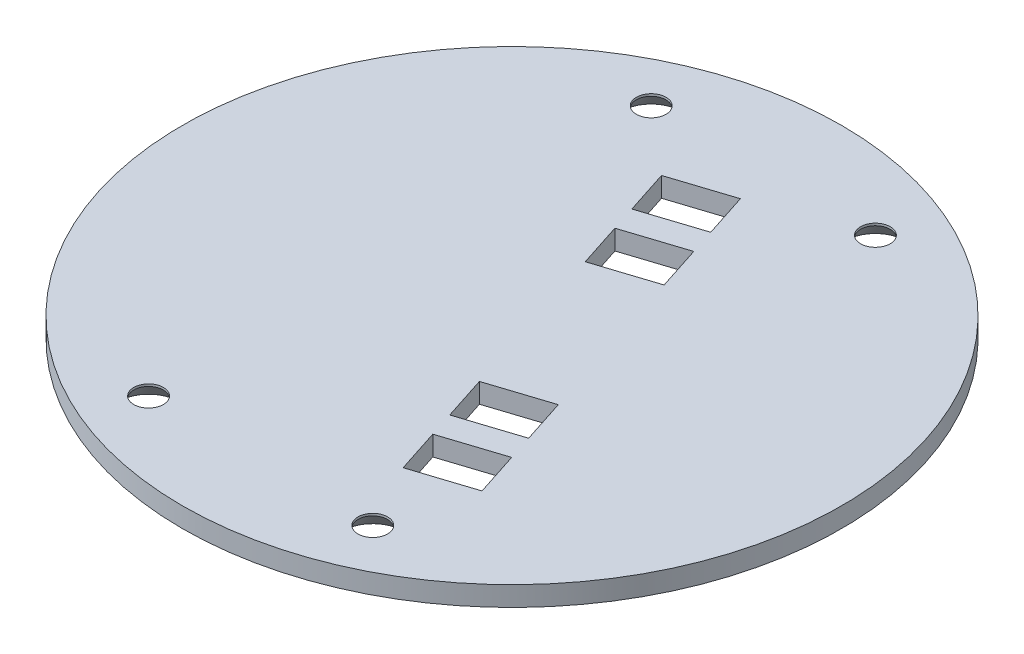
ISO-10303-21;
HEADER;
FILE_DESCRIPTION(('STEP AP214'),'2;1');
FILE_NAME('part.step','',(''),(''),'','','');
FILE_SCHEMA(('AUTOMOTIVE_DESIGN { 1 0 10303 214 1 1 1 1 }'));
ENDSEC;
DATA;
#1=APPLICATION_CONTEXT('core data for automotive mechanical design processes');
#2=APPLICATION_PROTOCOL_DEFINITION('international standard','automotive_design',2000,#1);
#3=PRODUCT_CONTEXT('',#1,'mechanical');
#4=PRODUCT('Part','Part','',(#3));
#5=PRODUCT_RELATED_PRODUCT_CATEGORY('part','',(#4));
#6=PRODUCT_DEFINITION_FORMATION('','',#4);
#7=PRODUCT_DEFINITION_CONTEXT('part definition',#1,'design');
#8=PRODUCT_DEFINITION('design','',#6,#7);
#9=PRODUCT_DEFINITION_SHAPE('','',#8);
#10=(LENGTH_UNIT() NAMED_UNIT(*) SI_UNIT(.MILLI.,.METRE.));
#11=(NAMED_UNIT(*) PLANE_ANGLE_UNIT() SI_UNIT($,.RADIAN.));
#12=(NAMED_UNIT(*) SI_UNIT($,.STERADIAN.) SOLID_ANGLE_UNIT());
#13=UNCERTAINTY_MEASURE_WITH_UNIT(LENGTH_MEASURE(1.E-05),#10,'distance_accuracy_value','');
#14=(GEOMETRIC_REPRESENTATION_CONTEXT(3) GLOBAL_UNCERTAINTY_ASSIGNED_CONTEXT((#13)) GLOBAL_UNIT_ASSIGNED_CONTEXT((#10,
#11,#12)) REPRESENTATION_CONTEXT('',''));
#15=CARTESIAN_POINT('',(0.,0.,0.));
#16=DIRECTION('',(0.,0.,1.));
#17=DIRECTION('',(1.,0.,0.));
#18=AXIS2_PLACEMENT_3D('',#15,#16,#17);
#19=CARTESIAN_POINT('',(0.,1.5,0.));
#20=DIRECTION('',(0.,1.,0.));
#21=DIRECTION('',(0.,0.,1.));
#22=AXIS2_PLACEMENT_3D('',#19,#20,#21);
#23=PLANE('',#22);
#24=CARTESIAN_POINT('',(17.0092592584861,1.5,38.1280421668568));
#25=DIRECTION('',(0.,-1.,0.));
#26=DIRECTION('',(0.,0.,-1.));
#27=AXIS2_PLACEMENT_3D('',#24,#25,#26);
#28=CIRCLE('',#27,2.2479);
#29=CARTESIAN_POINT('',(17.0092592584861,1.5,35.8801421668568));
#30=VERTEX_POINT('',#29);
#31=EDGE_CURVE('E365',#30,#30,#28,.T.);
#32=ORIENTED_EDGE('',*,*,#31,.T.);
#33=EDGE_LOOP('',(#32));
#34=FACE_BOUND('',#33,.T.);
#35=CARTESIAN_POINT('',(-17.0092592584861,1.5,38.1280421668568));
#36=DIRECTION('',(0.,-1.,0.));
#37=DIRECTION('',(0.,0.,-1.));
#38=AXIS2_PLACEMENT_3D('',#35,#36,#37);
#39=CIRCLE('',#38,2.2479);
#40=CARTESIAN_POINT('',(-17.0092592584861,1.5,35.8801421668568));
#41=VERTEX_POINT('',#40);
#42=EDGE_CURVE('E369',#41,#41,#39,.T.);
#43=ORIENTED_EDGE('',*,*,#42,.T.);
#44=EDGE_LOOP('',(#43));
#45=FACE_BOUND('',#44,.T.);
#46=CARTESIAN_POINT('',(-17.009259258486,1.5,-38.1280421668568));
#47=DIRECTION('',(0.,-1.,0.));
#48=DIRECTION('',(0.,0.,-1.));
#49=AXIS2_PLACEMENT_3D('',#46,#47,#48);
#50=CIRCLE('',#49,2.2479);
#51=CARTESIAN_POINT('',(-17.009259258486,1.5,-40.3759421668567));
#52=VERTEX_POINT('',#51);
#53=EDGE_CURVE('E373',#52,#52,#50,.T.);
#54=ORIENTED_EDGE('',*,*,#53,.T.);
#55=EDGE_LOOP('',(#54));
#56=FACE_BOUND('',#55,.T.);
#57=CARTESIAN_POINT('',(17.009259258486,1.5,-38.1280421668568));
#58=DIRECTION('',(0.,-1.,0.));
#59=DIRECTION('',(0.,0.,-1.));
#60=AXIS2_PLACEMENT_3D('',#57,#58,#59);
#61=CIRCLE('',#60,2.2479);
#62=CARTESIAN_POINT('',(17.009259258486,1.5,-40.3759421668567));
#63=VERTEX_POINT('',#62);
#64=EDGE_CURVE('E377',#63,#63,#61,.T.);
#65=ORIENTED_EDGE('',*,*,#64,.T.);
#66=EDGE_LOOP('',(#65));
#67=FACE_BOUND('',#66,.T.);
#68=DIRECTION('',(0.308303520094528,0.,0.951288042339082));
#69=VECTOR('',#68,1.);
#70=CARTESIAN_POINT('',(-7.06797710635094,1.5,-29.7553595949385));
#71=LINE('',#70,#69);
#72=CARTESIAN_POINT('',(-7.06797710635094,1.5,-29.7553595949385));
#73=VERTEX_POINT('',#72);
#74=CARTESIAN_POINT('',(-4.90985246568924,1.5,-23.0963432985649));
#75=VERTEX_POINT('',#74);
#76=EDGE_CURVE('E54',#73,#75,#71,.T.);
#77=ORIENTED_EDGE('',*,*,#76,.F.);
#78=DIRECTION('',(-0.951288042339082,0.,0.308303520094528));
#79=VECTOR('',#78,1.);
#80=CARTESIAN_POINT('',(1.96925929587035,1.5,-32.6842430358365));
#81=LINE('',#80,#79);
#82=CARTESIAN_POINT('',(1.96925929587035,1.5,-32.6842430358365));
#83=VERTEX_POINT('',#82);
#84=EDGE_CURVE('E171',#83,#73,#81,.T.);
#85=ORIENTED_EDGE('',*,*,#84,.F.);
#86=DIRECTION('',(-0.308303520094528,0.,-0.951288042339082));
#87=VECTOR('',#86,1.);
#88=CARTESIAN_POINT('',(4.12738393653204,1.5,-26.025226739463));
#89=LINE('',#88,#87);
#90=CARTESIAN_POINT('',(4.12738393653204,1.5,-26.025226739463));
#91=VERTEX_POINT('',#90);
#92=EDGE_CURVE('E177',#91,#83,#89,.T.);
#93=ORIENTED_EDGE('',*,*,#92,.F.);
#94=DIRECTION('',(0.951288042339082,0.,-0.308303520094528));
#95=VECTOR('',#94,1.);
#96=CARTESIAN_POINT('',(-4.90985246568924,1.5,-23.0963432985649));
#97=LINE('',#96,#95);
#98=EDGE_CURVE('E189',#75,#91,#97,.T.);
#99=ORIENTED_EDGE('',*,*,#98,.F.);
#100=EDGE_LOOP('',(#77,#85,#93,#99));
#101=FACE_BOUND('',#100,.T.);
#102=DIRECTION('',(-0.308303520094528,0.,-0.951288042339082));
#103=VECTOR('',#102,1.);
#104=CARTESIAN_POINT('',(5.36059801691015,1.5,-22.2200745701066));
#105=LINE('',#104,#103);
#106=CARTESIAN_POINT('',(7.51872265757185,1.5,-15.5610582737331));
#107=VERTEX_POINT('',#106);
#108=CARTESIAN_POINT('',(5.36059801691015,1.5,-22.2200745701066));
#109=VERTEX_POINT('',#108);
#110=EDGE_CURVE('E199',#107,#109,#105,.T.);
#111=ORIENTED_EDGE('',*,*,#110,.F.);
#112=DIRECTION('',(0.951288042339082,0.,-0.308303520094528));
#113=VECTOR('',#112,1.);
#114=CARTESIAN_POINT('',(7.51872265757185,1.5,-15.5610582737331));
#115=LINE('',#114,#113);
#116=CARTESIAN_POINT('',(-1.51851374464943,1.5,-12.632174832835));
#117=VERTEX_POINT('',#116);
#118=EDGE_CURVE('E210',#117,#107,#115,.T.);
#119=ORIENTED_EDGE('',*,*,#118,.F.);
#120=DIRECTION('',(0.308303520094528,0.,0.951288042339082));
#121=VECTOR('',#120,1.);
#122=CARTESIAN_POINT('',(-1.51851374464943,1.5,-12.632174832835));
#123=LINE('',#122,#121);
#124=CARTESIAN_POINT('',(-3.67663838531113,1.5,-19.2911911292086));
#125=VERTEX_POINT('',#124);
#126=EDGE_CURVE('E229',#125,#117,#123,.T.);
#127=ORIENTED_EDGE('',*,*,#126,.F.);
#128=DIRECTION('',(-0.951288042339082,0.,0.308303520094528));
#129=VECTOR('',#128,1.);
#130=CARTESIAN_POINT('',(-3.67663838531113,1.5,-19.2911911292086));
#131=LINE('',#130,#129);
#132=EDGE_CURVE('E225',#109,#125,#131,.T.);
#133=ORIENTED_EDGE('',*,*,#132,.F.);
#134=EDGE_LOOP('',(#111,#119,#127,#133));
#135=FACE_BOUND('',#134,.T.);
#136=DIRECTION('',(0.308303520094527,0.,0.951288042339082));
#137=VECTOR('',#136,1.);
#138=CARTESIAN_POINT('',(11.7292885138124,1.5,28.2446723464753));
#139=LINE('',#138,#137);
#140=CARTESIAN_POINT('',(9.57116387315074,1.5,21.5856560501018));
#141=VERTEX_POINT('',#140);
#142=CARTESIAN_POINT('',(11.7292885138124,1.5,28.2446723464753));
#143=VERTEX_POINT('',#142);
#144=EDGE_CURVE('E239',#141,#143,#139,.T.);
#145=ORIENTED_EDGE('',*,*,#144,.F.);
#146=DIRECTION('',(-0.951288042339082,0.,0.308303520094527));
#147=VECTOR('',#146,1.);
#148=CARTESIAN_POINT('',(9.57116387315074,1.5,21.5856560501018));
#149=LINE('',#148,#147);
#150=CARTESIAN_POINT('',(18.608400275372,1.5,18.6567726092037));
#151=VERTEX_POINT('',#150);
#152=EDGE_CURVE('E254',#151,#141,#149,.T.);
#153=ORIENTED_EDGE('',*,*,#152,.F.);
#154=DIRECTION('',(-0.308303520094528,0.,-0.951288042339082));
#155=VECTOR('',#154,1.);
#156=CARTESIAN_POINT('',(18.608400275372,1.5,18.6567726092037));
#157=LINE('',#156,#155);
#158=CARTESIAN_POINT('',(20.7665249160337,1.5,25.3157889055773));
#159=VERTEX_POINT('',#158);
#160=EDGE_CURVE('E273',#159,#151,#157,.T.);
#161=ORIENTED_EDGE('',*,*,#160,.F.);
#162=DIRECTION('',(0.951288042339082,0.,-0.308303520094527));
#163=VECTOR('',#162,1.);
#164=CARTESIAN_POINT('',(20.7665249160337,1.5,25.3157889055773));
#165=LINE('',#164,#163);
#166=EDGE_CURVE('E269',#143,#159,#165,.T.);
#167=ORIENTED_EDGE('',*,*,#166,.F.);
#168=EDGE_LOOP('',(#145,#153,#161,#167));
#169=FACE_BOUND('',#168,.T.);
#170=DIRECTION('',(0.308303520094528,0.,0.951288042339082));
#171=VECTOR('',#170,1.);
#172=CARTESIAN_POINT('',(6.17982515211094,1.5,11.1214875843719));
#173=LINE('',#172,#171);
#174=CARTESIAN_POINT('',(6.17982515211094,1.5,11.1214875843719));
#175=VERTEX_POINT('',#174);
#176=CARTESIAN_POINT('',(8.33794979277263,1.5,17.7805038807454));
#177=VERTEX_POINT('',#176);
#178=EDGE_CURVE('E283',#175,#177,#173,.T.);
#179=ORIENTED_EDGE('',*,*,#178,.F.);
#180=DIRECTION('',(-0.951288042339082,0.,0.308303520094528));
#181=VECTOR('',#180,1.);
#182=CARTESIAN_POINT('',(15.2170615543322,1.5,8.19260414347383));
#183=LINE('',#182,#181);
#184=CARTESIAN_POINT('',(15.2170615543322,1.5,8.19260414347383));
#185=VERTEX_POINT('',#184);
#186=EDGE_CURVE('E298',#185,#175,#183,.T.);
#187=ORIENTED_EDGE('',*,*,#186,.F.);
#188=DIRECTION('',(-0.308303520094528,0.,-0.951288042339082));
#189=VECTOR('',#188,1.);
#190=CARTESIAN_POINT('',(17.3751861949939,1.5,14.8516204398474));
#191=LINE('',#190,#189);
#192=CARTESIAN_POINT('',(17.3751861949939,1.5,14.8516204398474));
#193=VERTEX_POINT('',#192);
#194=EDGE_CURVE('E316',#193,#185,#191,.T.);
#195=ORIENTED_EDGE('',*,*,#194,.F.);
#196=DIRECTION('',(0.951288042339082,0.,-0.308303520094528));
#197=VECTOR('',#196,1.);
#198=CARTESIAN_POINT('',(8.33794979277263,1.5,17.7805038807454));
#199=LINE('',#198,#197);
#200=EDGE_CURVE('E312',#177,#193,#199,.T.);
#201=ORIENTED_EDGE('',*,*,#200,.F.);
#202=EDGE_LOOP('',(#179,#187,#195,#201));
#203=FACE_BOUND('',#202,.T.);
#204=CARTESIAN_POINT('',(0.,1.5,0.));
#205=DIRECTION('',(0.,1.,0.));
#206=DIRECTION('',(0.,0.,1.));
#207=AXIS2_PLACEMENT_3D('',#204,#205,#206);
#208=CIRCLE('',#207,50.);
#209=CARTESIAN_POINT('',(0.,1.5,50.));
#210=VERTEX_POINT('',#209);
#211=EDGE_CURVE('E180',#210,#210,#208,.T.);
#212=ORIENTED_EDGE('',*,*,#211,.T.);
#213=EDGE_LOOP('',(#212));
#214=FACE_BOUND('',#213,.T.);
#215=ADVANCED_FACE('F36',(#34,#45,#56,#67,#101,#135,#169,#203,#214),#23,.T.);
#216=CARTESIAN_POINT('',(0.,-1.5,0.));
#217=DIRECTION('',(0.,1.,0.));
#218=DIRECTION('',(0.,0.,1.));
#219=AXIS2_PLACEMENT_3D('',#216,#217,#218);
#220=PLANE('',#219);
#221=CARTESIAN_POINT('',(17.0092592584861,-1.5,38.1280421668568));
#222=DIRECTION('',(0.,-1.,0.));
#223=DIRECTION('',(0.,0.,-1.));
#224=AXIS2_PLACEMENT_3D('',#221,#222,#223);
#225=CIRCLE('',#224,4.5593);
#226=CARTESIAN_POINT('',(17.0092592584861,-1.5,33.5687421668568));
#227=VERTEX_POINT('',#226);
#228=EDGE_CURVE('E696',#227,#227,#225,.T.);
#229=ORIENTED_EDGE('',*,*,#228,.F.);
#230=EDGE_LOOP('',(#229));
#231=FACE_BOUND('',#230,.T.);
#232=CARTESIAN_POINT('',(-17.0092592584861,-1.5,38.1280421668568));
#233=DIRECTION('',(0.,-1.,0.));
#234=DIRECTION('',(0.,0.,-1.));
#235=AXIS2_PLACEMENT_3D('',#232,#233,#234);
#236=CIRCLE('',#235,4.5593);
#237=CARTESIAN_POINT('',(-17.0092592584861,-1.5,33.5687421668568));
#238=VERTEX_POINT('',#237);
#239=EDGE_CURVE('E704',#238,#238,#236,.T.);
#240=ORIENTED_EDGE('',*,*,#239,.F.);
#241=EDGE_LOOP('',(#240));
#242=FACE_BOUND('',#241,.T.);
#243=CARTESIAN_POINT('',(-17.009259258486,-1.5,-38.1280421668568));
#244=DIRECTION('',(0.,-1.,0.));
#245=DIRECTION('',(0.,0.,-1.));
#246=AXIS2_PLACEMENT_3D('',#243,#244,#245);
#247=CIRCLE('',#246,4.5593);
#248=CARTESIAN_POINT('',(-17.009259258486,-1.5,-42.6873421668568));
#249=VERTEX_POINT('',#248);
#250=EDGE_CURVE('E713',#249,#249,#247,.T.);
#251=ORIENTED_EDGE('',*,*,#250,.F.);
#252=EDGE_LOOP('',(#251));
#253=FACE_BOUND('',#252,.T.);
#254=CARTESIAN_POINT('',(17.009259258486,-1.5,-38.1280421668568));
#255=DIRECTION('',(0.,-1.,0.));
#256=DIRECTION('',(0.,0.,-1.));
#257=AXIS2_PLACEMENT_3D('',#254,#255,#256);
#258=CIRCLE('',#257,4.5593);
#259=CARTESIAN_POINT('',(17.009259258486,-1.5,-42.6873421668568));
#260=VERTEX_POINT('',#259);
#261=EDGE_CURVE('E722',#260,#260,#258,.T.);
#262=ORIENTED_EDGE('',*,*,#261,.F.);
#263=EDGE_LOOP('',(#262));
#264=FACE_BOUND('',#263,.T.);
#265=DIRECTION('',(-0.951288042339082,0.,0.308303520094528));
#266=VECTOR('',#265,1.);
#267=CARTESIAN_POINT('',(1.96925929587035,-1.5,-32.6842430358365));
#268=LINE('',#267,#266);
#269=CARTESIAN_POINT('',(1.96925929587035,-1.5,-32.6842430358365));
#270=VERTEX_POINT('',#269);
#271=CARTESIAN_POINT('',(-7.06797710635094,-1.5,-29.7553595949385));
#272=VERTEX_POINT('',#271);
#273=EDGE_CURVE('E160',#270,#272,#268,.T.);
#274=ORIENTED_EDGE('',*,*,#273,.T.);
#275=DIRECTION('',(0.308303520094528,0.,0.951288042339082));
#276=VECTOR('',#275,1.);
#277=CARTESIAN_POINT('',(-7.06797710635094,-1.5,-29.7553595949385));
#278=LINE('',#277,#276);
#279=CARTESIAN_POINT('',(-4.90985246568924,-1.5,-23.0963432985649));
#280=VERTEX_POINT('',#279);
#281=EDGE_CURVE('E153',#272,#280,#278,.T.);
#282=ORIENTED_EDGE('',*,*,#281,.T.);
#283=DIRECTION('',(0.951288042339082,0.,-0.308303520094528));
#284=VECTOR('',#283,1.);
#285=CARTESIAN_POINT('',(-4.90985246568924,-1.5,-23.0963432985649));
#286=LINE('',#285,#284);
#287=CARTESIAN_POINT('',(4.12738393653204,-1.5,-26.025226739463));
#288=VERTEX_POINT('',#287);
#289=EDGE_CURVE('E163',#280,#288,#286,.T.);
#290=ORIENTED_EDGE('',*,*,#289,.T.);
#291=DIRECTION('',(-0.308303520094528,0.,-0.951288042339082));
#292=VECTOR('',#291,1.);
#293=CARTESIAN_POINT('',(4.12738393653204,-1.5,-26.025226739463));
#294=LINE('',#293,#292);
#295=EDGE_CURVE('E62',#288,#270,#294,.T.);
#296=ORIENTED_EDGE('',*,*,#295,.T.);
#297=EDGE_LOOP('',(#274,#282,#290,#296));
#298=FACE_BOUND('',#297,.T.);
#299=DIRECTION('',(0.951288042339082,0.,-0.308303520094528));
#300=VECTOR('',#299,1.);
#301=CARTESIAN_POINT('',(7.51872265757185,-1.5,-15.5610582737331));
#302=LINE('',#301,#300);
#303=CARTESIAN_POINT('',(-1.51851374464943,-1.5,-12.632174832835));
#304=VERTEX_POINT('',#303);
#305=CARTESIAN_POINT('',(7.51872265757185,-1.5,-15.5610582737331));
#306=VERTEX_POINT('',#305);
#307=EDGE_CURVE('E218',#304,#306,#302,.T.);
#308=ORIENTED_EDGE('',*,*,#307,.T.);
#309=DIRECTION('',(-0.308303520094528,0.,-0.951288042339082));
#310=VECTOR('',#309,1.);
#311=CARTESIAN_POINT('',(5.36059801691015,-1.5,-22.2200745701066));
#312=LINE('',#311,#310);
#313=CARTESIAN_POINT('',(5.36059801691015,-1.5,-22.2200745701066));
#314=VERTEX_POINT('',#313);
#315=EDGE_CURVE('E205',#306,#314,#312,.T.);
#316=ORIENTED_EDGE('',*,*,#315,.T.);
#317=DIRECTION('',(-0.951288042339082,0.,0.308303520094528));
#318=VECTOR('',#317,1.);
#319=CARTESIAN_POINT('',(-3.67663838531113,-1.5,-19.2911911292086));
#320=LINE('',#319,#318);
#321=CARTESIAN_POINT('',(-3.67663838531113,-1.5,-19.2911911292086));
#322=VERTEX_POINT('',#321);
#323=EDGE_CURVE('E209',#314,#322,#320,.T.);
#324=ORIENTED_EDGE('',*,*,#323,.T.);
#325=DIRECTION('',(0.308303520094528,0.,0.951288042339082));
#326=VECTOR('',#325,1.);
#327=CARTESIAN_POINT('',(-1.51851374464943,-1.5,-12.632174832835));
#328=LINE('',#327,#326);
#329=EDGE_CURVE('E214',#322,#304,#328,.T.);
#330=ORIENTED_EDGE('',*,*,#329,.T.);
#331=EDGE_LOOP('',(#308,#316,#324,#330));
#332=FACE_BOUND('',#331,.T.);
#333=DIRECTION('',(-0.951288042339082,0.,0.308303520094527));
#334=VECTOR('',#333,1.);
#335=CARTESIAN_POINT('',(9.57116387315074,-1.5,21.5856560501018));
#336=LINE('',#335,#334);
#337=CARTESIAN_POINT('',(18.608400275372,-1.5,18.6567726092037));
#338=VERTEX_POINT('',#337);
#339=CARTESIAN_POINT('',(9.57116387315074,-1.5,21.5856560501018));
#340=VERTEX_POINT('',#339);
#341=EDGE_CURVE('E262',#338,#340,#336,.T.);
#342=ORIENTED_EDGE('',*,*,#341,.T.);
#343=DIRECTION('',(0.308303520094527,0.,0.951288042339082));
#344=VECTOR('',#343,1.);
#345=CARTESIAN_POINT('',(11.7292885138124,-1.5,28.2446723464753));
#346=LINE('',#345,#344);
#347=CARTESIAN_POINT('',(11.7292885138124,-1.5,28.2446723464753));
#348=VERTEX_POINT('',#347);
#349=EDGE_CURVE('E249',#340,#348,#346,.T.);
#350=ORIENTED_EDGE('',*,*,#349,.T.);
#351=DIRECTION('',(0.951288042339082,0.,-0.308303520094527));
#352=VECTOR('',#351,1.);
#353=CARTESIAN_POINT('',(20.7665249160337,-1.5,25.3157889055773));
#354=LINE('',#353,#352);
#355=CARTESIAN_POINT('',(20.7665249160337,-1.5,25.3157889055773));
#356=VERTEX_POINT('',#355);
#357=EDGE_CURVE('E253',#348,#356,#354,.T.);
#358=ORIENTED_EDGE('',*,*,#357,.T.);
#359=DIRECTION('',(-0.308303520094528,0.,-0.951288042339082));
#360=VECTOR('',#359,1.);
#361=CARTESIAN_POINT('',(18.608400275372,-1.5,18.6567726092037));
#362=LINE('',#361,#360);
#363=EDGE_CURVE('E258',#356,#338,#362,.T.);
#364=ORIENTED_EDGE('',*,*,#363,.T.);
#365=EDGE_LOOP('',(#342,#350,#358,#364));
#366=FACE_BOUND('',#365,.T.);
#367=DIRECTION('',(-0.951288042339082,0.,0.308303520094528));
#368=VECTOR('',#367,1.);
#369=CARTESIAN_POINT('',(15.2170615543322,-1.5,8.19260414347383));
#370=LINE('',#369,#368);
#371=CARTESIAN_POINT('',(15.2170615543322,-1.5,8.19260414347383));
#372=VERTEX_POINT('',#371);
#373=CARTESIAN_POINT('',(6.17982515211094,-1.5,11.1214875843719));
#374=VERTEX_POINT('',#373);
#375=EDGE_CURVE('E306',#372,#374,#370,.T.);
#376=ORIENTED_EDGE('',*,*,#375,.T.);
#377=DIRECTION('',(0.308303520094528,0.,0.951288042339082));
#378=VECTOR('',#377,1.);
#379=CARTESIAN_POINT('',(6.17982515211094,-1.5,11.1214875843719));
#380=LINE('',#379,#378);
#381=CARTESIAN_POINT('',(8.33794979277263,-1.5,17.7805038807454));
#382=VERTEX_POINT('',#381);
#383=EDGE_CURVE('E293',#374,#382,#380,.T.);
#384=ORIENTED_EDGE('',*,*,#383,.T.);
#385=DIRECTION('',(0.951288042339082,0.,-0.308303520094528));
#386=VECTOR('',#385,1.);
#387=CARTESIAN_POINT('',(8.33794979277263,-1.5,17.7805038807454));
#388=LINE('',#387,#386);
#389=CARTESIAN_POINT('',(17.3751861949939,-1.5,14.8516204398474));
#390=VERTEX_POINT('',#389);
#391=EDGE_CURVE('E297',#382,#390,#388,.T.);
#392=ORIENTED_EDGE('',*,*,#391,.T.);
#393=DIRECTION('',(-0.308303520094528,0.,-0.951288042339082));
#394=VECTOR('',#393,1.);
#395=CARTESIAN_POINT('',(17.3751861949939,-1.5,14.8516204398474));
#396=LINE('',#395,#394);
#397=EDGE_CURVE('E302',#390,#372,#396,.T.);
#398=ORIENTED_EDGE('',*,*,#397,.T.);
#399=EDGE_LOOP('',(#376,#384,#392,#398));
#400=FACE_BOUND('',#399,.T.);
#401=CARTESIAN_POINT('',(0.,-1.5,0.));
#402=DIRECTION('',(0.,1.,0.));
#403=DIRECTION('',(0.,0.,1.));
#404=AXIS2_PLACEMENT_3D('',#401,#402,#403);
#405=CIRCLE('',#404,50.);
#406=CARTESIAN_POINT('',(0.,-1.5,50.));
#407=VERTEX_POINT('',#406);
#408=EDGE_CURVE('E190',#407,#407,#405,.F.);
#409=ORIENTED_EDGE('',*,*,#408,.T.);
#410=EDGE_LOOP('',(#409));
#411=FACE_BOUND('',#410,.T.);
#412=ADVANCED_FACE('F38',(#231,#242,#253,#264,#298,#332,#366,#400,#411),#220,.F.);
#413=CARTESIAN_POINT('',(6.17982515211094,-1.5,11.1214875843719));
#414=DIRECTION('',(-0.951288042339082,0.,0.308303520094528));
#415=DIRECTION('',(0.308303520094528,0.,0.951288042339082));
#416=AXIS2_PLACEMENT_3D('',#413,#414,#415);
#417=PLANE('',#416);
#418=ORIENTED_EDGE('',*,*,#178,.T.);
#419=DIRECTION('',(0.,1.,0.));
#420=VECTOR('',#419,1.);
#421=CARTESIAN_POINT('',(8.33794979277263,-1.5,17.7805038807454));
#422=LINE('',#421,#420);
#423=EDGE_CURVE('E40',#382,#177,#422,.T.);
#424=ORIENTED_EDGE('',*,*,#423,.F.);
#425=ORIENTED_EDGE('',*,*,#383,.F.);
#426=DIRECTION('',(0.,1.,0.));
#427=VECTOR('',#426,1.);
#428=CARTESIAN_POINT('',(6.17982515211094,-1.5,11.1214875843719));
#429=LINE('',#428,#427);
#430=EDGE_CURVE('E11',#374,#175,#429,.T.);
#431=ORIENTED_EDGE('',*,*,#430,.T.);
#432=EDGE_LOOP('',(#418,#424,#425,#431));
#433=FACE_BOUND('',#432,.T.);
#434=ADVANCED_FACE('F348',(#433),#417,.F.);
#435=CARTESIAN_POINT('',(15.2170615543322,-1.5,8.19260414347383));
#436=DIRECTION('',(-0.308303520094528,0.,-0.951288042339082));
#437=DIRECTION('',(-0.951288042339082,0.,0.308303520094528));
#438=AXIS2_PLACEMENT_3D('',#435,#436,#437);
#439=PLANE('',#438);
#440=ORIENTED_EDGE('',*,*,#186,.T.);
#441=ORIENTED_EDGE('',*,*,#430,.F.);
#442=ORIENTED_EDGE('',*,*,#375,.F.);
#443=DIRECTION('',(0.,1.,0.));
#444=VECTOR('',#443,1.);
#445=CARTESIAN_POINT('',(15.2170615543322,-1.5,8.19260414347383));
#446=LINE('',#445,#444);
#447=EDGE_CURVE('E46',#372,#185,#446,.T.);
#448=ORIENTED_EDGE('',*,*,#447,.T.);
#449=EDGE_LOOP('',(#440,#441,#442,#448));
#450=FACE_BOUND('',#449,.T.);
#451=ADVANCED_FACE('F345',(#450),#439,.F.);
#452=CARTESIAN_POINT('',(17.3751861949939,-1.5,14.8516204398474));
#453=DIRECTION('',(0.951288042339082,0.,-0.308303520094528));
#454=DIRECTION('',(-0.308303520094528,0.,-0.951288042339082));
#455=AXIS2_PLACEMENT_3D('',#452,#453,#454);
#456=PLANE('',#455);
#457=ORIENTED_EDGE('',*,*,#194,.T.);
#458=ORIENTED_EDGE('',*,*,#447,.F.);
#459=ORIENTED_EDGE('',*,*,#397,.F.);
#460=DIRECTION('',(0.,1.,0.));
#461=VECTOR('',#460,1.);
#462=CARTESIAN_POINT('',(17.3751861949939,-1.5,14.8516204398474));
#463=LINE('',#462,#461);
#464=EDGE_CURVE('E323',#390,#193,#463,.T.);
#465=ORIENTED_EDGE('',*,*,#464,.T.);
#466=EDGE_LOOP('',(#457,#458,#459,#465));
#467=FACE_BOUND('',#466,.T.);
#468=ADVANCED_FACE('F342',(#467),#456,.F.);
#469=CARTESIAN_POINT('',(8.33794979277263,-1.5,17.7805038807454));
#470=DIRECTION('',(0.308303520094528,0.,0.951288042339082));
#471=DIRECTION('',(0.951288042339082,0.,-0.308303520094528));
#472=AXIS2_PLACEMENT_3D('',#469,#470,#471);
#473=PLANE('',#472);
#474=ORIENTED_EDGE('',*,*,#200,.T.);
#475=ORIENTED_EDGE('',*,*,#464,.F.);
#476=ORIENTED_EDGE('',*,*,#391,.F.);
#477=ORIENTED_EDGE('',*,*,#423,.T.);
#478=EDGE_LOOP('',(#474,#475,#476,#477));
#479=FACE_BOUND('',#478,.T.);
#480=ADVANCED_FACE('F334',(#479),#473,.F.);
#481=CARTESIAN_POINT('',(11.7292885138124,-1.5,28.2446723464753));
#482=DIRECTION('',(-0.951288042339082,0.,0.308303520094527));
#483=DIRECTION('',(0.308303520094528,0.,0.951288042339082));
#484=AXIS2_PLACEMENT_3D('',#481,#482,#483);
#485=PLANE('',#484);
#486=ORIENTED_EDGE('',*,*,#144,.T.);
#487=DIRECTION('',(0.,1.,0.));
#488=VECTOR('',#487,1.);
#489=CARTESIAN_POINT('',(11.7292885138124,-1.5,28.2446723464753));
#490=LINE('',#489,#488);
#491=EDGE_CURVE('E266',#348,#143,#490,.T.);
#492=ORIENTED_EDGE('',*,*,#491,.F.);
#493=ORIENTED_EDGE('',*,*,#349,.F.);
#494=DIRECTION('',(0.,1.,0.));
#495=VECTOR('',#494,1.);
#496=CARTESIAN_POINT('',(9.57116387315074,-1.5,21.5856560501018));
#497=LINE('',#496,#495);
#498=EDGE_CURVE('E280',#340,#141,#497,.T.);
#499=ORIENTED_EDGE('',*,*,#498,.T.);
#500=EDGE_LOOP('',(#486,#492,#493,#499));
#501=FACE_BOUND('',#500,.T.);
#502=ADVANCED_FACE('F389',(#501),#485,.F.);
#503=CARTESIAN_POINT('',(9.57116387315074,-1.5,21.5856560501018));
#504=DIRECTION('',(-0.308303520094527,0.,-0.951288042339082));
#505=DIRECTION('',(-0.951288042339082,0.,0.308303520094527));
#506=AXIS2_PLACEMENT_3D('',#503,#504,#505);
#507=PLANE('',#506);
#508=ORIENTED_EDGE('',*,*,#152,.T.);
#509=ORIENTED_EDGE('',*,*,#498,.F.);
#510=ORIENTED_EDGE('',*,*,#341,.F.);
#511=DIRECTION('',(0.,1.,0.));
#512=VECTOR('',#511,1.);
#513=CARTESIAN_POINT('',(18.608400275372,-1.5,18.6567726092037));
#514=LINE('',#513,#512);
#515=EDGE_CURVE('E284',#338,#151,#514,.T.);
#516=ORIENTED_EDGE('',*,*,#515,.T.);
#517=EDGE_LOOP('',(#508,#509,#510,#516));
#518=FACE_BOUND('',#517,.T.);
#519=ADVANCED_FACE('F398',(#518),#507,.F.);
#520=CARTESIAN_POINT('',(18.608400275372,-1.5,18.6567726092037));
#521=DIRECTION('',(0.951288042339082,0.,-0.308303520094528));
#522=DIRECTION('',(-0.308303520094528,0.,-0.951288042339082));
#523=AXIS2_PLACEMENT_3D('',#520,#521,#522);
#524=PLANE('',#523);
#525=ORIENTED_EDGE('',*,*,#160,.T.);
#526=ORIENTED_EDGE('',*,*,#515,.F.);
#527=ORIENTED_EDGE('',*,*,#363,.F.);
#528=DIRECTION('',(0.,1.,0.));
#529=VECTOR('',#528,1.);
#530=CARTESIAN_POINT('',(20.7665249160337,-1.5,25.3157889055773));
#531=LINE('',#530,#529);
#532=EDGE_CURVE('E287',#356,#159,#531,.T.);
#533=ORIENTED_EDGE('',*,*,#532,.T.);
#534=EDGE_LOOP('',(#525,#526,#527,#533));
#535=FACE_BOUND('',#534,.T.);
#536=ADVANCED_FACE('F400',(#535),#524,.F.);
#537=CARTESIAN_POINT('',(20.7665249160337,-1.5,25.3157889055773));
#538=DIRECTION('',(0.308303520094527,0.,0.951288042339082));
#539=DIRECTION('',(0.951288042339082,0.,-0.308303520094527));
#540=AXIS2_PLACEMENT_3D('',#537,#538,#539);
#541=PLANE('',#540);
#542=ORIENTED_EDGE('',*,*,#166,.T.);
#543=ORIENTED_EDGE('',*,*,#532,.F.);
#544=ORIENTED_EDGE('',*,*,#357,.F.);
#545=ORIENTED_EDGE('',*,*,#491,.T.);
#546=EDGE_LOOP('',(#542,#543,#544,#545));
#547=FACE_BOUND('',#546,.T.);
#548=ADVANCED_FACE('F393',(#547),#541,.F.);
#549=CARTESIAN_POINT('',(5.36059801691015,-1.5,-22.2200745701066));
#550=DIRECTION('',(0.951288042339082,0.,-0.308303520094528));
#551=DIRECTION('',(-0.308303520094528,0.,-0.951288042339082));
#552=AXIS2_PLACEMENT_3D('',#549,#550,#551);
#553=PLANE('',#552);
#554=ORIENTED_EDGE('',*,*,#110,.T.);
#555=DIRECTION('',(0.,1.,0.));
#556=VECTOR('',#555,1.);
#557=CARTESIAN_POINT('',(5.36059801691015,-1.5,-22.2200745701066));
#558=LINE('',#557,#556);
#559=EDGE_CURVE('E222',#314,#109,#558,.T.);
#560=ORIENTED_EDGE('',*,*,#559,.F.);
#561=ORIENTED_EDGE('',*,*,#315,.F.);
#562=DIRECTION('',(0.,1.,0.));
#563=VECTOR('',#562,1.);
#564=CARTESIAN_POINT('',(7.51872265757185,-1.5,-15.5610582737331));
#565=LINE('',#564,#563);
#566=EDGE_CURVE('E236',#306,#107,#565,.T.);
#567=ORIENTED_EDGE('',*,*,#566,.T.);
#568=EDGE_LOOP('',(#554,#560,#561,#567));
#569=FACE_BOUND('',#568,.T.);
#570=ADVANCED_FACE('F407',(#569),#553,.F.);
#571=CARTESIAN_POINT('',(7.51872265757185,-1.5,-15.5610582737331));
#572=DIRECTION('',(0.308303520094528,0.,0.951288042339082));
#573=DIRECTION('',(0.951288042339082,0.,-0.308303520094528));
#574=AXIS2_PLACEMENT_3D('',#571,#572,#573);
#575=PLANE('',#574);
#576=ORIENTED_EDGE('',*,*,#118,.T.);
#577=ORIENTED_EDGE('',*,*,#566,.F.);
#578=ORIENTED_EDGE('',*,*,#307,.F.);
#579=DIRECTION('',(0.,1.,0.));
#580=VECTOR('',#579,1.);
#581=CARTESIAN_POINT('',(-1.51851374464943,-1.5,-12.632174832835));
#582=LINE('',#581,#580);
#583=EDGE_CURVE('E240',#304,#117,#582,.T.);
#584=ORIENTED_EDGE('',*,*,#583,.T.);
#585=EDGE_LOOP('',(#576,#577,#578,#584));
#586=FACE_BOUND('',#585,.T.);
#587=ADVANCED_FACE('F441',(#586),#575,.F.);
#588=CARTESIAN_POINT('',(-1.51851374464943,-1.5,-12.632174832835));
#589=DIRECTION('',(-0.951288042339082,0.,0.308303520094528));
#590=DIRECTION('',(0.308303520094528,0.,0.951288042339082));
#591=AXIS2_PLACEMENT_3D('',#588,#589,#590);
#592=PLANE('',#591);
#593=ORIENTED_EDGE('',*,*,#126,.T.);
#594=ORIENTED_EDGE('',*,*,#583,.F.);
#595=ORIENTED_EDGE('',*,*,#329,.F.);
#596=DIRECTION('',(0.,1.,0.));
#597=VECTOR('',#596,1.);
#598=CARTESIAN_POINT('',(-3.67663838531113,-1.5,-19.2911911292086));
#599=LINE('',#598,#597);
#600=EDGE_CURVE('E243',#322,#125,#599,.T.);
#601=ORIENTED_EDGE('',*,*,#600,.T.);
#602=EDGE_LOOP('',(#593,#594,#595,#601));
#603=FACE_BOUND('',#602,.T.);
#604=ADVANCED_FACE('F449',(#603),#592,.F.);
#605=CARTESIAN_POINT('',(-3.67663838531113,-1.5,-19.2911911292086));
#606=DIRECTION('',(-0.308303520094528,0.,-0.951288042339082));
#607=DIRECTION('',(-0.951288042339082,0.,0.308303520094528));
#608=AXIS2_PLACEMENT_3D('',#605,#606,#607);
#609=PLANE('',#608);
#610=ORIENTED_EDGE('',*,*,#132,.T.);
#611=ORIENTED_EDGE('',*,*,#600,.F.);
#612=ORIENTED_EDGE('',*,*,#323,.F.);
#613=ORIENTED_EDGE('',*,*,#559,.T.);
#614=EDGE_LOOP('',(#610,#611,#612,#613));
#615=FACE_BOUND('',#614,.T.);
#616=ADVANCED_FACE('F458',(#615),#609,.F.);
#617=CARTESIAN_POINT('',(-7.06797710635094,-1.5,-29.7553595949385));
#618=DIRECTION('',(-0.951288042339082,0.,0.308303520094528));
#619=DIRECTION('',(0.308303520094528,0.,0.951288042339082));
#620=AXIS2_PLACEMENT_3D('',#617,#618,#619);
#621=PLANE('',#620);
#622=ORIENTED_EDGE('',*,*,#76,.T.);
#623=DIRECTION('',(0.,1.,0.));
#624=VECTOR('',#623,1.);
#625=CARTESIAN_POINT('',(-4.90985246568924,-1.5,-23.0963432985649));
#626=LINE('',#625,#624);
#627=EDGE_CURVE('E149',#280,#75,#626,.T.);
#628=ORIENTED_EDGE('',*,*,#627,.F.);
#629=ORIENTED_EDGE('',*,*,#281,.F.);
#630=DIRECTION('',(0.,1.,0.));
#631=VECTOR('',#630,1.);
#632=CARTESIAN_POINT('',(-7.06797710635094,-1.5,-29.7553595949385));
#633=LINE('',#632,#631);
#634=EDGE_CURVE('E196',#272,#73,#633,.T.);
#635=ORIENTED_EDGE('',*,*,#634,.T.);
#636=EDGE_LOOP('',(#622,#628,#629,#635));
#637=FACE_BOUND('',#636,.T.);
#638=ADVANCED_FACE('F151',(#637),#621,.F.);
#639=CARTESIAN_POINT('',(1.96925929587035,-1.5,-32.6842430358365));
#640=DIRECTION('',(-0.308303520094528,0.,-0.951288042339082));
#641=DIRECTION('',(-0.951288042339082,0.,0.308303520094528));
#642=AXIS2_PLACEMENT_3D('',#639,#640,#641);
#643=PLANE('',#642);
#644=ORIENTED_EDGE('',*,*,#84,.T.);
#645=ORIENTED_EDGE('',*,*,#634,.F.);
#646=ORIENTED_EDGE('',*,*,#273,.F.);
#647=DIRECTION('',(0.,1.,0.));
#648=VECTOR('',#647,1.);
#649=CARTESIAN_POINT('',(1.96925929587035,-1.5,-32.6842430358365));
#650=LINE('',#649,#648);
#651=EDGE_CURVE('E200',#270,#83,#650,.T.);
#652=ORIENTED_EDGE('',*,*,#651,.T.);
#653=EDGE_LOOP('',(#644,#645,#646,#652));
#654=FACE_BOUND('',#653,.T.);
#655=ADVANCED_FACE('F475',(#654),#643,.F.);
#656=CARTESIAN_POINT('',(4.12738393653204,-1.5,-26.025226739463));
#657=DIRECTION('',(0.951288042339082,0.,-0.308303520094528));
#658=DIRECTION('',(-0.308303520094528,0.,-0.951288042339082));
#659=AXIS2_PLACEMENT_3D('',#656,#657,#658);
#660=PLANE('',#659);
#661=ORIENTED_EDGE('',*,*,#92,.T.);
#662=ORIENTED_EDGE('',*,*,#651,.F.);
#663=ORIENTED_EDGE('',*,*,#295,.F.);
#664=DIRECTION('',(0.,1.,0.));
#665=VECTOR('',#664,1.);
#666=CARTESIAN_POINT('',(4.12738393653204,-1.5,-26.025226739463));
#667=LINE('',#666,#665);
#668=EDGE_CURVE('E159',#288,#91,#667,.T.);
#669=ORIENTED_EDGE('',*,*,#668,.T.);
#670=EDGE_LOOP('',(#661,#662,#663,#669));
#671=FACE_BOUND('',#670,.T.);
#672=ADVANCED_FACE('F483',(#671),#660,.F.);
#673=CARTESIAN_POINT('',(-4.90985246568924,-1.5,-23.0963432985649));
#674=DIRECTION('',(0.308303520094529,0.,0.951288042339082));
#675=DIRECTION('',(0.951288042339082,0.,-0.308303520094529));
#676=AXIS2_PLACEMENT_3D('',#673,#674,#675);
#677=PLANE('',#676);
#678=ORIENTED_EDGE('',*,*,#98,.T.);
#679=ORIENTED_EDGE('',*,*,#668,.F.);
#680=ORIENTED_EDGE('',*,*,#289,.F.);
#681=ORIENTED_EDGE('',*,*,#627,.T.);
#682=EDGE_LOOP('',(#678,#679,#680,#681));
#683=FACE_BOUND('',#682,.T.);
#684=ADVANCED_FACE('F164',(#683),#677,.F.);
#685=CARTESIAN_POINT('',(0.,-142.92135623731,0.));
#686=DIRECTION('',(0.,1.,0.));
#687=DIRECTION('',(0.,0.,1.));
#688=AXIS2_PLACEMENT_3D('',#685,#686,#687);
#689=CYLINDRICAL_SURFACE('',#688,50.);
#690=ORIENTED_EDGE('',*,*,#408,.F.);
#691=EDGE_LOOP('',(#690));
#692=FACE_BOUND('',#691,.T.);
#693=ORIENTED_EDGE('',*,*,#211,.F.);
#694=EDGE_LOOP('',(#693));
#695=FACE_BOUND('',#694,.T.);
#696=ADVANCED_FACE('F499',(#692,#695),#689,.T.);
#697=CARTESIAN_POINT('',(17.009259258486,-1.5,-38.1280421668568));
#698=DIRECTION('',(0.,-1.,0.));
#699=DIRECTION('',(0.,0.,-1.));
#700=AXIS2_PLACEMENT_3D('',#697,#698,#699);
#701=CYLINDRICAL_SURFACE('',#700,2.24789999999999);
#702=ORIENTED_EDGE('',*,*,#64,.F.);
#703=EDGE_LOOP('',(#702));
#704=FACE_BOUND('',#703,.T.);
#705=CARTESIAN_POINT('',(17.009259258486,1.15896153645065,-38.1280421668568));
#706=DIRECTION('',(0.,-1.,0.));
#707=DIRECTION('',(0.,0.,-1.));
#708=AXIS2_PLACEMENT_3D('',#705,#706,#707);
#709=CIRCLE('',#708,2.24789999999999);
#710=CARTESIAN_POINT('',(17.009259258486,1.15896153645065,-40.3759421668567));
#711=VERTEX_POINT('',#710);
#712=EDGE_CURVE('E725',#711,#711,#709,.T.);
#713=ORIENTED_EDGE('',*,*,#712,.T.);
#714=EDGE_LOOP('',(#713));
#715=FACE_BOUND('',#714,.T.);
#716=ADVANCED_FACE('F507',(#704,#715),#701,.F.);
#717=CARTESIAN_POINT('',(17.009259258486,-1.5,-38.1280421668568));
#718=DIRECTION('',(0.,-1.,0.));
#719=DIRECTION('',(0.,0.,-1.));
#720=AXIS2_PLACEMENT_3D('',#717,#718,#719);
#721=CONICAL_SURFACE('',#720,4.5593,0.715584993317676);
#722=ORIENTED_EDGE('',*,*,#712,.F.);
#723=EDGE_LOOP('',(#722));
#724=FACE_BOUND('',#723,.T.);
#725=ORIENTED_EDGE('',*,*,#261,.T.);
#726=EDGE_LOOP('',(#725));
#727=FACE_BOUND('',#726,.T.);
#728=ADVANCED_FACE('F517',(#724,#727),#721,.F.);
#729=CARTESIAN_POINT('',(-17.009259258486,-1.5,-38.1280421668568));
#730=DIRECTION('',(0.,-1.,0.));
#731=DIRECTION('',(0.,0.,-1.));
#732=AXIS2_PLACEMENT_3D('',#729,#730,#731);
#733=CYLINDRICAL_SURFACE('',#732,2.24789999999999);
#734=ORIENTED_EDGE('',*,*,#53,.F.);
#735=EDGE_LOOP('',(#734));
#736=FACE_BOUND('',#735,.T.);
#737=CARTESIAN_POINT('',(-17.009259258486,1.15896153645065,-38.1280421668568));
#738=DIRECTION('',(0.,-1.,0.));
#739=DIRECTION('',(0.,0.,-1.));
#740=AXIS2_PLACEMENT_3D('',#737,#738,#739);
#741=CIRCLE('',#740,2.24789999999999);
#742=CARTESIAN_POINT('',(-17.009259258486,1.15896153645065,-40.3759421668567));
#743=VERTEX_POINT('',#742);
#744=EDGE_CURVE('E717',#743,#743,#741,.T.);
#745=ORIENTED_EDGE('',*,*,#744,.T.);
#746=EDGE_LOOP('',(#745));
#747=FACE_BOUND('',#746,.T.);
#748=ADVANCED_FACE('F527',(#736,#747),#733,.F.);
#749=CARTESIAN_POINT('',(-17.009259258486,-1.5,-38.1280421668568));
#750=DIRECTION('',(0.,-1.,0.));
#751=DIRECTION('',(0.,0.,-1.));
#752=AXIS2_PLACEMENT_3D('',#749,#750,#751);
#753=CONICAL_SURFACE('',#752,4.5593,0.715584993317676);
#754=ORIENTED_EDGE('',*,*,#744,.F.);
#755=EDGE_LOOP('',(#754));
#756=FACE_BOUND('',#755,.T.);
#757=ORIENTED_EDGE('',*,*,#250,.T.);
#758=EDGE_LOOP('',(#757));
#759=FACE_BOUND('',#758,.T.);
#760=ADVANCED_FACE('F536',(#756,#759),#753,.F.);
#761=CARTESIAN_POINT('',(-17.0092592584861,-1.5,38.1280421668568));
#762=DIRECTION('',(0.,-1.,0.));
#763=DIRECTION('',(0.,0.,-1.));
#764=AXIS2_PLACEMENT_3D('',#761,#762,#763);
#765=CYLINDRICAL_SURFACE('',#764,2.24789999999999);
#766=ORIENTED_EDGE('',*,*,#42,.F.);
#767=EDGE_LOOP('',(#766));
#768=FACE_BOUND('',#767,.T.);
#769=CARTESIAN_POINT('',(-17.0092592584861,1.15896153645065,38.1280421668568));
#770=DIRECTION('',(0.,-1.,0.));
#771=DIRECTION('',(0.,0.,-1.));
#772=AXIS2_PLACEMENT_3D('',#769,#770,#771);
#773=CIRCLE('',#772,2.24789999999999);
#774=CARTESIAN_POINT('',(-17.0092592584861,1.15896153645065,35.8801421668568));
#775=VERTEX_POINT('',#774);
#776=EDGE_CURVE('E707',#775,#775,#773,.T.);
#777=ORIENTED_EDGE('',*,*,#776,.T.);
#778=EDGE_LOOP('',(#777));
#779=FACE_BOUND('',#778,.T.);
#780=ADVANCED_FACE('F545',(#768,#779),#765,.F.);
#781=CARTESIAN_POINT('',(-17.0092592584861,-1.5,38.1280421668568));
#782=DIRECTION('',(0.,-1.,0.));
#783=DIRECTION('',(0.,0.,-1.));
#784=AXIS2_PLACEMENT_3D('',#781,#782,#783);
#785=CONICAL_SURFACE('',#784,4.5593,0.715584993317676);
#786=ORIENTED_EDGE('',*,*,#776,.F.);
#787=EDGE_LOOP('',(#786));
#788=FACE_BOUND('',#787,.T.);
#789=ORIENTED_EDGE('',*,*,#239,.T.);
#790=EDGE_LOOP('',(#789));
#791=FACE_BOUND('',#790,.T.);
#792=ADVANCED_FACE('F554',(#788,#791),#785,.F.);
#793=CARTESIAN_POINT('',(17.0092592584861,-1.5,38.1280421668568));
#794=DIRECTION('',(0.,-1.,0.));
#795=DIRECTION('',(0.,0.,-1.));
#796=AXIS2_PLACEMENT_3D('',#793,#794,#795);
#797=CYLINDRICAL_SURFACE('',#796,2.24789999999999);
#798=ORIENTED_EDGE('',*,*,#31,.F.);
#799=EDGE_LOOP('',(#798));
#800=FACE_BOUND('',#799,.T.);
#801=CARTESIAN_POINT('',(17.0092592584861,1.15896153645065,38.1280421668568));
#802=DIRECTION('',(0.,-1.,0.));
#803=DIRECTION('',(0.,0.,-1.));
#804=AXIS2_PLACEMENT_3D('',#801,#802,#803);
#805=CIRCLE('',#804,2.24789999999999);
#806=CARTESIAN_POINT('',(17.0092592584861,1.15896153645065,35.8801421668568));
#807=VERTEX_POINT('',#806);
#808=EDGE_CURVE('E693',#807,#807,#805,.T.);
#809=ORIENTED_EDGE('',*,*,#808,.T.);
#810=EDGE_LOOP('',(#809));
#811=FACE_BOUND('',#810,.T.);
#812=ADVANCED_FACE('F563',(#800,#811),#797,.F.);
#813=CARTESIAN_POINT('',(17.0092592584861,-1.5,38.1280421668568));
#814=DIRECTION('',(0.,-1.,0.));
#815=DIRECTION('',(0.,0.,-1.));
#816=AXIS2_PLACEMENT_3D('',#813,#814,#815);
#817=CONICAL_SURFACE('',#816,4.5593,0.715584993317676);
#818=ORIENTED_EDGE('',*,*,#808,.F.);
#819=EDGE_LOOP('',(#818));
#820=FACE_BOUND('',#819,.T.);
#821=ORIENTED_EDGE('',*,*,#228,.T.);
#822=EDGE_LOOP('',(#821));
#823=FACE_BOUND('',#822,.T.);
#824=ADVANCED_FACE('F572',(#820,#823),#817,.F.);
#825=CLOSED_SHELL('',(#215,#412,#434,#451,#468,#480,#502,#519,#536,#548,#570,#587,#604,#616,
#638,#655,#672,#684,#696,#716,#728,#748,#760,#780,#792,#812,#824));
#826=MANIFOLD_SOLID_BREP('B2',#825);
#827=ADVANCED_BREP_SHAPE_REPRESENTATION('',(#18,#826),#14);
#828=SHAPE_DEFINITION_REPRESENTATION(#9,#827);
ENDSEC;
END-ISO-10303-21;
